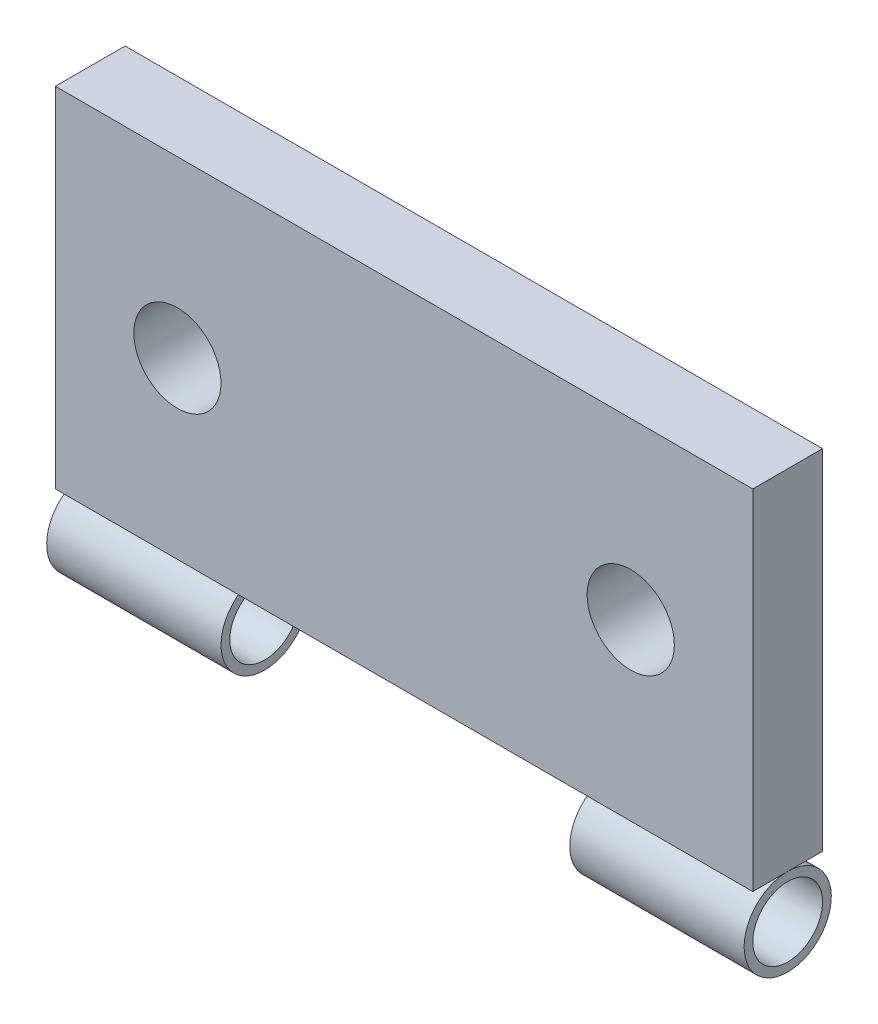
ISO-10303-21;
HEADER;
FILE_DESCRIPTION(('STEP AP214'),'2;1');
FILE_NAME('part.step','',(''),(''),'','','');
FILE_SCHEMA(('AUTOMOTIVE_DESIGN { 1 0 10303 214 1 1 1 1 }'));
ENDSEC;
DATA;
#1=APPLICATION_CONTEXT('core data for automotive mechanical design processes');
#2=APPLICATION_PROTOCOL_DEFINITION('international standard','automotive_design',2000,#1);
#3=PRODUCT_CONTEXT('',#1,'mechanical');
#4=PRODUCT('Part','Part','',(#3));
#5=PRODUCT_RELATED_PRODUCT_CATEGORY('part','',(#4));
#6=PRODUCT_DEFINITION_FORMATION('','',#4);
#7=PRODUCT_DEFINITION_CONTEXT('part definition',#1,'design');
#8=PRODUCT_DEFINITION('design','',#6,#7);
#9=PRODUCT_DEFINITION_SHAPE('','',#8);
#10=(LENGTH_UNIT() NAMED_UNIT(*) SI_UNIT(.MILLI.,.METRE.));
#11=(NAMED_UNIT(*) PLANE_ANGLE_UNIT() SI_UNIT($,.RADIAN.));
#12=(NAMED_UNIT(*) SI_UNIT($,.STERADIAN.) SOLID_ANGLE_UNIT());
#13=UNCERTAINTY_MEASURE_WITH_UNIT(LENGTH_MEASURE(1.E-05),#10,'distance_accuracy_value','');
#14=(GEOMETRIC_REPRESENTATION_CONTEXT(3) GLOBAL_UNCERTAINTY_ASSIGNED_CONTEXT((#13)) GLOBAL_UNIT_ASSIGNED_CONTEXT((#10,
#11,#12)) REPRESENTATION_CONTEXT('',''));
#15=CARTESIAN_POINT('',(0.,0.,0.));
#16=DIRECTION('',(0.,0.,1.));
#17=DIRECTION('',(1.,0.,0.));
#18=AXIS2_PLACEMENT_3D('',#15,#16,#17);
#19=CARTESIAN_POINT('',(20.,-12.5,-0.00334052788275585));
#20=DIRECTION('',(-1.,0.,0.));
#21=DIRECTION('',(0.,-1.,0.));
#22=AXIS2_PLACEMENT_3D('',#19,#20,#21);
#23=CYLINDRICAL_SURFACE('',#22,2.5);
#24=CARTESIAN_POINT('',(-10.,-12.5,-0.00334052788275585));
#25=DIRECTION('',(-1.,0.,0.));
#26=DIRECTION('',(0.,-1.,0.));
#27=AXIS2_PLACEMENT_3D('',#24,#25,#26);
#28=CIRCLE('',#27,2.5);
#29=CARTESIAN_POINT('',(-10.,-15.,-0.00334052788275585));
#30=VERTEX_POINT('',#29);
#31=EDGE_CURVE('E11',#30,#30,#28,.F.);
#32=ORIENTED_EDGE('',*,*,#31,.F.);
#33=EDGE_LOOP('',(#32));
#34=FACE_BOUND('',#33,.T.);
#35=CARTESIAN_POINT('',(-20.,-12.5,-0.00334052788275585));
#36=DIRECTION('',(-1.,0.,0.));
#37=DIRECTION('',(0.,-1.,0.));
#38=AXIS2_PLACEMENT_3D('',#35,#36,#37);
#39=CIRCLE('',#38,2.5);
#40=CARTESIAN_POINT('',(-20.,-15.,-0.00334052788275585));
#41=VERTEX_POINT('',#40);
#42=EDGE_CURVE('E47',#41,#41,#39,.T.);
#43=ORIENTED_EDGE('',*,*,#42,.F.);
#44=EDGE_LOOP('',(#43));
#45=FACE_BOUND('',#44,.T.);
#46=ADVANCED_FACE('F40',(#34,#45),#23,.T.);
#47=CARTESIAN_POINT('',(20.,-12.5,-0.00334052788275585));
#48=DIRECTION('',(-1.,0.,0.));
#49=DIRECTION('',(0.,-1.,0.));
#50=AXIS2_PLACEMENT_3D('',#47,#48,#49);
#51=CYLINDRICAL_SURFACE('',#50,2.);
#52=CARTESIAN_POINT('',(-10.,-12.5,-0.00334052788275585));
#53=DIRECTION('',(-1.,0.,0.));
#54=DIRECTION('',(0.,-1.,0.));
#55=AXIS2_PLACEMENT_3D('',#52,#53,#54);
#56=CIRCLE('',#55,2.);
#57=CARTESIAN_POINT('',(-10.,-14.5,-0.00334052788275585));
#58=VERTEX_POINT('',#57);
#59=EDGE_CURVE('E56',#58,#58,#56,.F.);
#60=ORIENTED_EDGE('',*,*,#59,.T.);
#61=EDGE_LOOP('',(#60));
#62=FACE_BOUND('',#61,.T.);
#63=CARTESIAN_POINT('',(-20.,-12.5,-0.00334052788275585));
#64=DIRECTION('',(-1.,0.,0.));
#65=DIRECTION('',(0.,-1.,0.));
#66=AXIS2_PLACEMENT_3D('',#63,#64,#65);
#67=CIRCLE('',#66,2.);
#68=CARTESIAN_POINT('',(-20.,-14.5,-0.00334052788275585));
#69=VERTEX_POINT('',#68);
#70=EDGE_CURVE('E51',#69,#69,#67,.T.);
#71=ORIENTED_EDGE('',*,*,#70,.T.);
#72=EDGE_LOOP('',(#71));
#73=FACE_BOUND('',#72,.T.);
#74=ADVANCED_FACE('F42',(#62,#73),#51,.F.);
#75=CARTESIAN_POINT('',(-20.,-12.5,-0.00334052788275585));
#76=DIRECTION('',(-1.,0.,0.));
#77=DIRECTION('',(0.,-1.,0.));
#78=AXIS2_PLACEMENT_3D('',#75,#76,#77);
#79=PLANE('',#78);
#80=ORIENTED_EDGE('',*,*,#70,.F.);
#81=EDGE_LOOP('',(#80));
#82=FACE_BOUND('',#81,.T.);
#83=ORIENTED_EDGE('',*,*,#42,.T.);
#84=EDGE_LOOP('',(#83));
#85=FACE_BOUND('',#84,.T.);
#86=ADVANCED_FACE('F65',(#82,#85),#79,.T.);
#87=CARTESIAN_POINT('',(-10.,-10.,-3.));
#88=DIRECTION('',(-1.,0.,0.));
#89=DIRECTION('',(0.,-1.,0.));
#90=AXIS2_PLACEMENT_3D('',#87,#88,#89);
#91=PLANE('',#90);
#92=ORIENTED_EDGE('',*,*,#31,.T.);
#93=EDGE_LOOP('',(#92));
#94=FACE_BOUND('',#93,.T.);
#95=ORIENTED_EDGE('',*,*,#59,.F.);
#96=EDGE_LOOP('',(#95));
#97=FACE_BOUND('',#96,.T.);
#98=ADVANCED_FACE('F63',(#94,#97),#91,.F.);
#99=CLOSED_SHELL('',(#46,#74,#86,#98));
#100=MANIFOLD_SOLID_BREP('B2',#99);
#101=CARTESIAN_POINT('',(20.,-12.5,-0.00334052788275585));
#102=DIRECTION('',(-1.,0.,0.));
#103=DIRECTION('',(0.,-1.,0.));
#104=AXIS2_PLACEMENT_3D('',#101,#102,#103);
#105=CYLINDRICAL_SURFACE('',#104,2.5);
#106=CARTESIAN_POINT('',(10.,-12.5,-0.00334052788275585));
#107=DIRECTION('',(1.,0.,0.));
#108=DIRECTION('',(0.,1.,0.));
#109=AXIS2_PLACEMENT_3D('',#106,#107,#108);
#110=CIRCLE('',#109,2.5);
#111=CARTESIAN_POINT('',(10.,-9.99999999999999,-0.00334052788275585));
#112=VERTEX_POINT('',#111);
#113=EDGE_CURVE('E122',#112,#112,#110,.F.);
#114=ORIENTED_EDGE('',*,*,#113,.F.);
#115=EDGE_LOOP('',(#114));
#116=FACE_BOUND('',#115,.T.);
#117=CARTESIAN_POINT('',(20.,-12.5,-0.00334052788275585));
#118=DIRECTION('',(-1.,0.,0.));
#119=DIRECTION('',(0.,-1.,0.));
#120=AXIS2_PLACEMENT_3D('',#117,#118,#119);
#121=CIRCLE('',#120,2.5);
#122=CARTESIAN_POINT('',(20.,-15.,-0.00334052788275585));
#123=VERTEX_POINT('',#122);
#124=EDGE_CURVE('E39',#123,#123,#121,.T.);
#125=ORIENTED_EDGE('',*,*,#124,.T.);
#126=EDGE_LOOP('',(#125));
#127=FACE_BOUND('',#126,.T.);
#128=ADVANCED_FACE('F111',(#116,#127),#105,.T.);
#129=CARTESIAN_POINT('',(20.,-12.5,-0.00334052788275585));
#130=DIRECTION('',(-1.,0.,0.));
#131=DIRECTION('',(0.,-1.,0.));
#132=AXIS2_PLACEMENT_3D('',#129,#130,#131);
#133=PLANE('',#132);
#134=CARTESIAN_POINT('',(20.,-12.5,-0.00334052788275585));
#135=DIRECTION('',(-1.,0.,0.));
#136=DIRECTION('',(0.,-1.,0.));
#137=AXIS2_PLACEMENT_3D('',#134,#135,#136);
#138=CIRCLE('',#137,2.);
#139=CARTESIAN_POINT('',(20.,-14.5,-0.00334052788275585));
#140=VERTEX_POINT('',#139);
#141=EDGE_CURVE('E118',#140,#140,#138,.T.);
#142=ORIENTED_EDGE('',*,*,#141,.T.);
#143=EDGE_LOOP('',(#142));
#144=FACE_BOUND('',#143,.T.);
#145=ORIENTED_EDGE('',*,*,#124,.F.);
#146=EDGE_LOOP('',(#145));
#147=FACE_BOUND('',#146,.T.);
#148=ADVANCED_FACE('F140',(#144,#147),#133,.F.);
#149=CARTESIAN_POINT('',(20.,-12.5,-0.00334052788275585));
#150=DIRECTION('',(-1.,0.,0.));
#151=DIRECTION('',(0.,-1.,0.));
#152=AXIS2_PLACEMENT_3D('',#149,#150,#151);
#153=CYLINDRICAL_SURFACE('',#152,2.);
#154=CARTESIAN_POINT('',(10.,-12.5,-0.00334052788275585));
#155=DIRECTION('',(1.,0.,0.));
#156=DIRECTION('',(0.,1.,0.));
#157=AXIS2_PLACEMENT_3D('',#154,#155,#156);
#158=CIRCLE('',#157,2.);
#159=CARTESIAN_POINT('',(10.,-10.5,-0.00334052788275585));
#160=VERTEX_POINT('',#159);
#161=EDGE_CURVE('E114',#160,#160,#158,.F.);
#162=ORIENTED_EDGE('',*,*,#161,.T.);
#163=EDGE_LOOP('',(#162));
#164=FACE_BOUND('',#163,.T.);
#165=ORIENTED_EDGE('',*,*,#141,.F.);
#166=EDGE_LOOP('',(#165));
#167=FACE_BOUND('',#166,.T.);
#168=ADVANCED_FACE('F131',(#164,#167),#153,.F.);
#169=CARTESIAN_POINT('',(10.,-10.,-3.));
#170=DIRECTION('',(1.,0.,0.));
#171=DIRECTION('',(0.,1.,0.));
#172=AXIS2_PLACEMENT_3D('',#169,#170,#171);
#173=PLANE('',#172);
#174=ORIENTED_EDGE('',*,*,#113,.T.);
#175=EDGE_LOOP('',(#174));
#176=FACE_BOUND('',#175,.T.);
#177=ORIENTED_EDGE('',*,*,#161,.F.);
#178=EDGE_LOOP('',(#177));
#179=FACE_BOUND('',#178,.T.);
#180=ADVANCED_FACE('F134',(#176,#179),#173,.F.);
#181=CLOSED_SHELL('',(#128,#148,#168,#180));
#182=MANIFOLD_SOLID_BREP('B6',#181);
#183=CARTESIAN_POINT('',(0.,0.,2.));
#184=DIRECTION('',(0.,0.,1.));
#185=DIRECTION('',(1.,0.,0.));
#186=AXIS2_PLACEMENT_3D('',#183,#184,#185);
#187=PLANE('',#186);
#188=CARTESIAN_POINT('',(-13.,0.,2.));
#189=DIRECTION('',(0.,0.,1.));
#190=DIRECTION('',(1.,0.,0.));
#191=AXIS2_PLACEMENT_3D('',#188,#189,#190);
#192=CIRCLE('',#191,2.5);
#193=CARTESIAN_POINT('',(-10.5,0.,2.));
#194=VERTEX_POINT('',#193);
#195=EDGE_CURVE('E238',#194,#194,#192,.T.);
#196=ORIENTED_EDGE('',*,*,#195,.F.);
#197=EDGE_LOOP('',(#196));
#198=FACE_BOUND('',#197,.T.);
#199=DIRECTION('',(0.,1.,0.));
#200=VECTOR('',#199,1.);
#201=CARTESIAN_POINT('',(20.,10.,2.));
#202=LINE('',#201,#200);
#203=CARTESIAN_POINT('',(20.,-10.,2.));
#204=VERTEX_POINT('',#203);
#205=CARTESIAN_POINT('',(20.,10.,2.));
#206=VERTEX_POINT('',#205);
#207=EDGE_CURVE('E223',#204,#206,#202,.T.);
#208=ORIENTED_EDGE('',*,*,#207,.T.);
#209=DIRECTION('',(-1.,0.,0.));
#210=VECTOR('',#209,1.);
#211=CARTESIAN_POINT('',(-20.,10.,2.));
#212=LINE('',#211,#210);
#213=CARTESIAN_POINT('',(-20.,10.,2.));
#214=VERTEX_POINT('',#213);
#215=EDGE_CURVE('E219',#206,#214,#212,.T.);
#216=ORIENTED_EDGE('',*,*,#215,.T.);
#217=DIRECTION('',(0.,-1.,0.));
#218=VECTOR('',#217,1.);
#219=CARTESIAN_POINT('',(-20.,10.,2.));
#220=LINE('',#219,#218);
#221=CARTESIAN_POINT('',(-20.,-10.,2.));
#222=VERTEX_POINT('',#221);
#223=EDGE_CURVE('E222',#214,#222,#220,.T.);
#224=ORIENTED_EDGE('',*,*,#223,.T.);
#225=DIRECTION('',(1.,0.,0.));
#226=VECTOR('',#225,1.);
#227=CARTESIAN_POINT('',(-20.,-10.,2.));
#228=LINE('',#227,#226);
#229=EDGE_CURVE('E190',#222,#204,#228,.T.);
#230=ORIENTED_EDGE('',*,*,#229,.T.);
#231=EDGE_LOOP('',(#208,#216,#224,#230));
#232=FACE_BOUND('',#231,.T.);
#233=CARTESIAN_POINT('',(13.,0.,2.));
#234=DIRECTION('',(0.,0.,1.));
#235=DIRECTION('',(1.,0.,0.));
#236=AXIS2_PLACEMENT_3D('',#233,#234,#235);
#237=CIRCLE('',#236,2.5);
#238=CARTESIAN_POINT('',(15.5,0.,2.));
#239=VERTEX_POINT('',#238);
#240=EDGE_CURVE('E251',#239,#239,#237,.T.);
#241=ORIENTED_EDGE('',*,*,#240,.F.);
#242=EDGE_LOOP('',(#241));
#243=FACE_BOUND('',#242,.T.);
#244=ADVANCED_FACE('F173',(#198,#232,#243),#187,.T.);
#245=CARTESIAN_POINT('',(0.,0.,-2.));
#246=DIRECTION('',(0.,0.,1.));
#247=DIRECTION('',(1.,0.,0.));
#248=AXIS2_PLACEMENT_3D('',#245,#246,#247);
#249=PLANE('',#248);
#250=DIRECTION('',(0.,1.,0.));
#251=VECTOR('',#250,1.);
#252=CARTESIAN_POINT('',(20.,10.,-2.));
#253=LINE('',#252,#251);
#254=CARTESIAN_POINT('',(20.,-10.,-2.));
#255=VERTEX_POINT('',#254);
#256=CARTESIAN_POINT('',(20.,10.,-2.));
#257=VERTEX_POINT('',#256);
#258=EDGE_CURVE('E236',#255,#257,#253,.T.);
#259=ORIENTED_EDGE('',*,*,#258,.F.);
#260=DIRECTION('',(1.,0.,0.));
#261=VECTOR('',#260,1.);
#262=CARTESIAN_POINT('',(-20.,-10.,-2.));
#263=LINE('',#262,#261);
#264=CARTESIAN_POINT('',(-20.,-10.,-2.));
#265=VERTEX_POINT('',#264);
#266=EDGE_CURVE('E242',#265,#255,#263,.T.);
#267=ORIENTED_EDGE('',*,*,#266,.F.);
#268=DIRECTION('',(0.,-1.,0.));
#269=VECTOR('',#268,1.);
#270=CARTESIAN_POINT('',(-20.,10.,-2.));
#271=LINE('',#270,#269);
#272=CARTESIAN_POINT('',(-20.,10.,-2.));
#273=VERTEX_POINT('',#272);
#274=EDGE_CURVE('E240',#273,#265,#271,.T.);
#275=ORIENTED_EDGE('',*,*,#274,.F.);
#276=DIRECTION('',(-1.,0.,0.));
#277=VECTOR('',#276,1.);
#278=CARTESIAN_POINT('',(-20.,10.,-2.));
#279=LINE('',#278,#277);
#280=EDGE_CURVE('E228',#257,#273,#279,.T.);
#281=ORIENTED_EDGE('',*,*,#280,.F.);
#282=EDGE_LOOP('',(#259,#267,#275,#281));
#283=FACE_BOUND('',#282,.T.);
#284=CARTESIAN_POINT('',(-13.,0.,-2.));
#285=DIRECTION('',(0.,0.,1.));
#286=DIRECTION('',(1.,0.,0.));
#287=AXIS2_PLACEMENT_3D('',#284,#285,#286);
#288=CIRCLE('',#287,2.5);
#289=CARTESIAN_POINT('',(-10.5,0.,-2.));
#290=VERTEX_POINT('',#289);
#291=EDGE_CURVE('E248',#290,#290,#288,.T.);
#292=ORIENTED_EDGE('',*,*,#291,.T.);
#293=EDGE_LOOP('',(#292));
#294=FACE_BOUND('',#293,.T.);
#295=CARTESIAN_POINT('',(13.,0.,-2.));
#296=DIRECTION('',(0.,0.,1.));
#297=DIRECTION('',(1.,0.,0.));
#298=AXIS2_PLACEMENT_3D('',#295,#296,#297);
#299=CIRCLE('',#298,2.5);
#300=CARTESIAN_POINT('',(15.5,0.,-2.));
#301=VERTEX_POINT('',#300);
#302=EDGE_CURVE('E254',#301,#301,#299,.T.);
#303=ORIENTED_EDGE('',*,*,#302,.T.);
#304=EDGE_LOOP('',(#303));
#305=FACE_BOUND('',#304,.T.);
#306=ADVANCED_FACE('F263',(#283,#294,#305),#249,.F.);
#307=CARTESIAN_POINT('',(20.,10.,2.));
#308=DIRECTION('',(-1.,0.,0.));
#309=DIRECTION('',(0.,0.,1.));
#310=AXIS2_PLACEMENT_3D('',#307,#308,#309);
#311=PLANE('',#310);
#312=ORIENTED_EDGE('',*,*,#258,.T.);
#313=DIRECTION('',(0.,0.,-1.));
#314=VECTOR('',#313,1.);
#315=CARTESIAN_POINT('',(20.,10.,2.));
#316=LINE('',#315,#314);
#317=EDGE_CURVE('E109',#206,#257,#316,.T.);
#318=ORIENTED_EDGE('',*,*,#317,.F.);
#319=ORIENTED_EDGE('',*,*,#207,.F.);
#320=DIRECTION('',(0.,0.,-1.));
#321=VECTOR('',#320,1.);
#322=CARTESIAN_POINT('',(20.,-10.,2.));
#323=LINE('',#322,#321);
#324=EDGE_CURVE('E213',#204,#255,#323,.T.);
#325=ORIENTED_EDGE('',*,*,#324,.T.);
#326=EDGE_LOOP('',(#312,#318,#319,#325));
#327=FACE_BOUND('',#326,.T.);
#328=ADVANCED_FACE('F175',(#327),#311,.F.);
#329=CARTESIAN_POINT('',(-20.,10.,2.));
#330=DIRECTION('',(0.,-1.,0.));
#331=DIRECTION('',(0.,0.,-1.));
#332=AXIS2_PLACEMENT_3D('',#329,#330,#331);
#333=PLANE('',#332);
#334=ORIENTED_EDGE('',*,*,#280,.T.);
#335=DIRECTION('',(0.,0.,-1.));
#336=VECTOR('',#335,1.);
#337=CARTESIAN_POINT('',(-20.,10.,2.));
#338=LINE('',#337,#336);
#339=EDGE_CURVE('E182',#214,#273,#338,.T.);
#340=ORIENTED_EDGE('',*,*,#339,.F.);
#341=ORIENTED_EDGE('',*,*,#215,.F.);
#342=ORIENTED_EDGE('',*,*,#317,.T.);
#343=EDGE_LOOP('',(#334,#340,#341,#342));
#344=FACE_BOUND('',#343,.T.);
#345=ADVANCED_FACE('F227',(#344),#333,.F.);
#346=CARTESIAN_POINT('',(-20.,10.,2.));
#347=DIRECTION('',(1.,0.,0.));
#348=DIRECTION('',(0.,1.,0.));
#349=AXIS2_PLACEMENT_3D('',#346,#347,#348);
#350=PLANE('',#349);
#351=ORIENTED_EDGE('',*,*,#274,.T.);
#352=DIRECTION('',(0.,0.,-1.));
#353=VECTOR('',#352,1.);
#354=CARTESIAN_POINT('',(-20.,-10.,2.));
#355=LINE('',#354,#353);
#356=EDGE_CURVE('E206',#222,#265,#355,.T.);
#357=ORIENTED_EDGE('',*,*,#356,.F.);
#358=ORIENTED_EDGE('',*,*,#223,.F.);
#359=ORIENTED_EDGE('',*,*,#339,.T.);
#360=EDGE_LOOP('',(#351,#357,#358,#359));
#361=FACE_BOUND('',#360,.T.);
#362=ADVANCED_FACE('F231',(#361),#350,.F.);
#363=CARTESIAN_POINT('',(-20.,-10.,2.));
#364=DIRECTION('',(0.,1.,0.));
#365=DIRECTION('',(0.,0.,1.));
#366=AXIS2_PLACEMENT_3D('',#363,#364,#365);
#367=PLANE('',#366);
#368=ORIENTED_EDGE('',*,*,#266,.T.);
#369=ORIENTED_EDGE('',*,*,#324,.F.);
#370=ORIENTED_EDGE('',*,*,#229,.F.);
#371=ORIENTED_EDGE('',*,*,#356,.T.);
#372=EDGE_LOOP('',(#368,#369,#370,#371));
#373=FACE_BOUND('',#372,.T.);
#374=ADVANCED_FACE('F276',(#373),#367,.F.);
#375=CARTESIAN_POINT('',(-13.,0.,2.));
#376=DIRECTION('',(0.,0.,-1.));
#377=DIRECTION('',(-1.,0.,0.));
#378=AXIS2_PLACEMENT_3D('',#375,#376,#377);
#379=CYLINDRICAL_SURFACE('',#378,2.5);
#380=ORIENTED_EDGE('',*,*,#195,.T.);
#381=EDGE_LOOP('',(#380));
#382=FACE_BOUND('',#381,.T.);
#383=ORIENTED_EDGE('',*,*,#291,.F.);
#384=EDGE_LOOP('',(#383));
#385=FACE_BOUND('',#384,.T.);
#386=ADVANCED_FACE('F273',(#382,#385),#379,.F.);
#387=CARTESIAN_POINT('',(13.,0.,2.));
#388=DIRECTION('',(0.,0.,-1.));
#389=DIRECTION('',(-1.,0.,0.));
#390=AXIS2_PLACEMENT_3D('',#387,#388,#389);
#391=CYLINDRICAL_SURFACE('',#390,2.5);
#392=ORIENTED_EDGE('',*,*,#240,.T.);
#393=EDGE_LOOP('',(#392));
#394=FACE_BOUND('',#393,.T.);
#395=ORIENTED_EDGE('',*,*,#302,.F.);
#396=EDGE_LOOP('',(#395));
#397=FACE_BOUND('',#396,.T.);
#398=ADVANCED_FACE('F260',(#394,#397),#391,.F.);
#399=CLOSED_SHELL('',(#244,#306,#328,#345,#362,#374,#386,#398));
#400=MANIFOLD_SOLID_BREP('B34',#399);
#401=ADVANCED_BREP_SHAPE_REPRESENTATION('',(#18,#100,#182,#400),#14);
#402=SHAPE_DEFINITION_REPRESENTATION(#9,#401);
ENDSEC;
END-ISO-10303-21;
